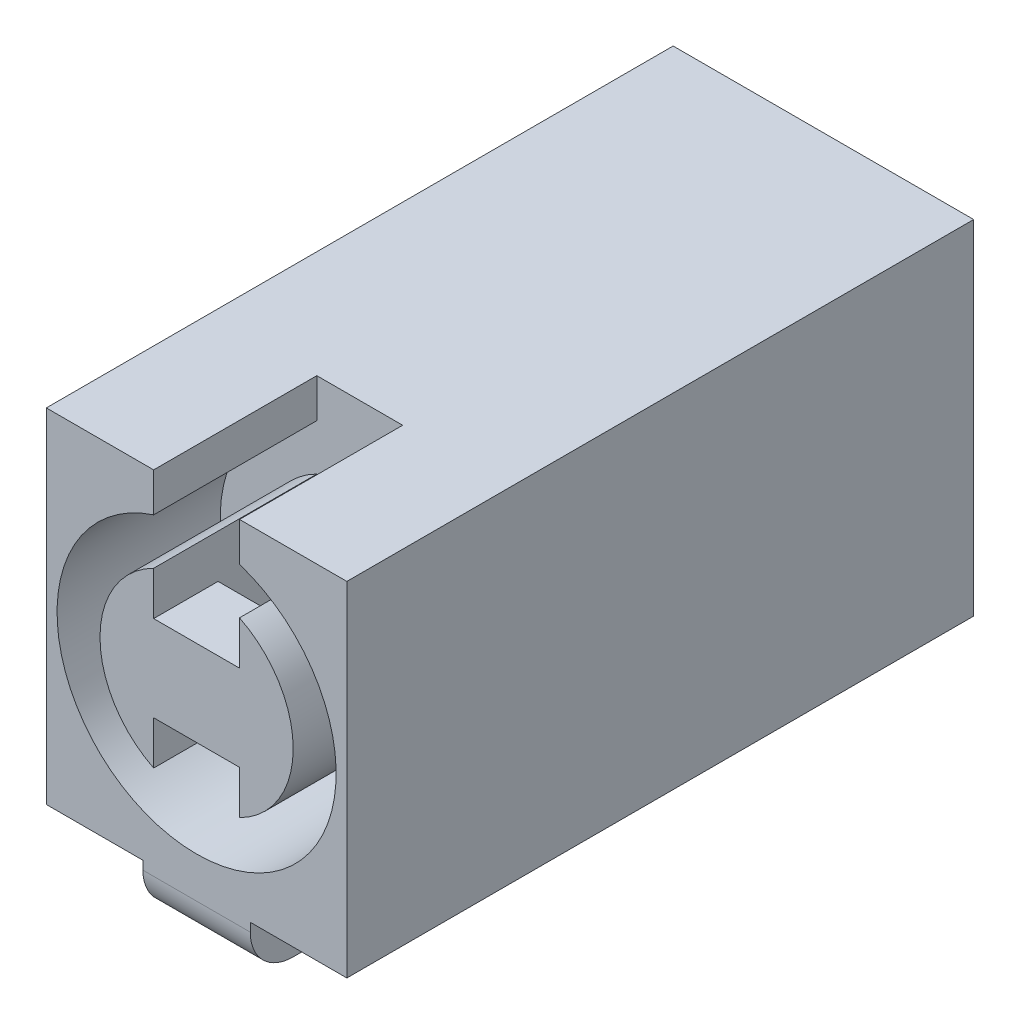
ISO-10303-21;
HEADER;
FILE_DESCRIPTION(('STEP AP214'),'2;1');
FILE_NAME('part.step','',(''),(''),'','','');
FILE_SCHEMA(('AUTOMOTIVE_DESIGN { 1 0 10303 214 1 1 1 1 }'));
ENDSEC;
DATA;
#1=APPLICATION_CONTEXT('core data for automotive mechanical design processes');
#2=APPLICATION_PROTOCOL_DEFINITION('international standard','automotive_design',2000,#1);
#3=PRODUCT_CONTEXT('',#1,'mechanical');
#4=PRODUCT('Part','Part','',(#3));
#5=PRODUCT_RELATED_PRODUCT_CATEGORY('part','',(#4));
#6=PRODUCT_DEFINITION_FORMATION('','',#4);
#7=PRODUCT_DEFINITION_CONTEXT('part definition',#1,'design');
#8=PRODUCT_DEFINITION('design','',#6,#7);
#9=PRODUCT_DEFINITION_SHAPE('','',#8);
#10=(LENGTH_UNIT() NAMED_UNIT(*) SI_UNIT(.MILLI.,.METRE.));
#11=(NAMED_UNIT(*) PLANE_ANGLE_UNIT() SI_UNIT($,.RADIAN.));
#12=(NAMED_UNIT(*) SI_UNIT($,.STERADIAN.) SOLID_ANGLE_UNIT());
#13=UNCERTAINTY_MEASURE_WITH_UNIT(LENGTH_MEASURE(1.E-05),#10,'distance_accuracy_value','');
#14=(GEOMETRIC_REPRESENTATION_CONTEXT(3) GLOBAL_UNCERTAINTY_ASSIGNED_CONTEXT((#13)) GLOBAL_UNIT_ASSIGNED_CONTEXT((#10,
#11,#12)) REPRESENTATION_CONTEXT('',''));
#15=CARTESIAN_POINT('',(0.,0.,0.));
#16=DIRECTION('',(0.,0.,1.));
#17=DIRECTION('',(1.,0.,0.));
#18=AXIS2_PLACEMENT_3D('',#15,#16,#17);
#19=CARTESIAN_POINT('',(2.5,3.5,-9.8));
#20=DIRECTION('',(-1.,0.,0.));
#21=DIRECTION('',(0.,0.,1.));
#22=AXIS2_PLACEMENT_3D('',#19,#20,#21);
#23=PLANE('',#22);
#24=DIRECTION('',(0.,1.,0.));
#25=VECTOR('',#24,1.);
#26=CARTESIAN_POINT('',(2.5,2.5,-7.8));
#27=LINE('',#26,#25);
#28=CARTESIAN_POINT('',(2.5,2.5,-7.8));
#29=VERTEX_POINT('',#28);
#30=CARTESIAN_POINT('',(2.5,3.5,-7.8));
#31=VERTEX_POINT('',#30);
#32=EDGE_CURVE('E606',#29,#31,#27,.T.);
#33=ORIENTED_EDGE('',*,*,#32,.F.);
#34=DIRECTION('',(0.,0.,-1.));
#35=VECTOR('',#34,1.);
#36=CARTESIAN_POINT('',(2.5,2.5,-7.8));
#37=LINE('',#36,#35);
#38=CARTESIAN_POINT('',(2.5,2.5,-6.8));
#39=VERTEX_POINT('',#38);
#40=EDGE_CURVE('E572',#39,#29,#37,.T.);
#41=ORIENTED_EDGE('',*,*,#40,.F.);
#42=DIRECTION('',(0.,1.,0.));
#43=VECTOR('',#42,1.);
#44=CARTESIAN_POINT('',(2.5,2.5,-6.8));
#45=LINE('',#44,#43);
#46=CARTESIAN_POINT('',(2.5,3.5,-6.8));
#47=VERTEX_POINT('',#46);
#48=EDGE_CURVE('E589',#39,#47,#45,.T.);
#49=ORIENTED_EDGE('',*,*,#48,.T.);
#50=DIRECTION('',(0.,0.,-1.));
#51=VECTOR('',#50,1.);
#52=CARTESIAN_POINT('',(2.5,3.5,-9.8));
#53=LINE('',#52,#51);
#54=CARTESIAN_POINT('',(2.5,3.5,-4.8));
#55=VERTEX_POINT('',#54);
#56=EDGE_CURVE('E409',#55,#47,#53,.T.);
#57=ORIENTED_EDGE('',*,*,#56,.F.);
#58=DIRECTION('',(0.,-1.,0.));
#59=VECTOR('',#58,1.);
#60=CARTESIAN_POINT('',(2.5,3.5,-4.8));
#61=LINE('',#60,#59);
#62=CARTESIAN_POINT('',(2.5,0.,-4.8));
#63=VERTEX_POINT('',#62);
#64=EDGE_CURVE('E309',#55,#63,#61,.T.);
#65=ORIENTED_EDGE('',*,*,#64,.T.);
#66=DIRECTION('',(0.,0.,-1.));
#67=VECTOR('',#66,1.);
#68=CARTESIAN_POINT('',(2.5,0.,-9.8));
#69=LINE('',#68,#67);
#70=CARTESIAN_POINT('',(2.5,0.,-9.8));
#71=VERTEX_POINT('',#70);
#72=EDGE_CURVE('E427',#63,#71,#69,.T.);
#73=ORIENTED_EDGE('',*,*,#72,.T.);
#74=DIRECTION('',(0.,-1.,0.));
#75=VECTOR('',#74,1.);
#76=CARTESIAN_POINT('',(2.5,3.5,-9.8));
#77=LINE('',#76,#75);
#78=CARTESIAN_POINT('',(2.5,3.5,-9.8));
#79=VERTEX_POINT('',#78);
#80=EDGE_CURVE('E426',#79,#71,#77,.T.);
#81=ORIENTED_EDGE('',*,*,#80,.F.);
#82=EDGE_CURVE('E413',#31,#79,#53,.T.);
#83=ORIENTED_EDGE('',*,*,#82,.F.);
#84=EDGE_LOOP('',(#33,#41,#49,#57,#65,#73,#81,#83));
#85=FACE_BOUND('',#84,.T.);
#86=ADVANCED_FACE('F40',(#85),#23,.F.);
#87=CARTESIAN_POINT('',(4.5,3.5,-9.8));
#88=DIRECTION('',(1.,0.,0.));
#89=DIRECTION('',(0.,0.,-1.));
#90=AXIS2_PLACEMENT_3D('',#87,#88,#89);
#91=PLANE('',#90);
#92=DIRECTION('',(0.,1.,0.));
#93=VECTOR('',#92,1.);
#94=CARTESIAN_POINT('',(4.5,2.5,-7.8));
#95=LINE('',#94,#93);
#96=CARTESIAN_POINT('',(4.5,2.5,-7.8));
#97=VERTEX_POINT('',#96);
#98=CARTESIAN_POINT('',(4.5,3.5,-7.8));
#99=VERTEX_POINT('',#98);
#100=EDGE_CURVE('E603',#97,#99,#95,.T.);
#101=ORIENTED_EDGE('',*,*,#100,.T.);
#102=DIRECTION('',(0.,0.,1.));
#103=VECTOR('',#102,1.);
#104=CARTESIAN_POINT('',(4.5,3.5,-9.8));
#105=LINE('',#104,#103);
#106=CARTESIAN_POINT('',(4.5,3.5,-9.8));
#107=VERTEX_POINT('',#106);
#108=EDGE_CURVE('E418',#107,#99,#105,.T.);
#109=ORIENTED_EDGE('',*,*,#108,.F.);
#110=DIRECTION('',(0.,-1.,0.));
#111=VECTOR('',#110,1.);
#112=CARTESIAN_POINT('',(4.5,3.5,-9.8));
#113=LINE('',#112,#111);
#114=CARTESIAN_POINT('',(4.5,0.,-9.8));
#115=VERTEX_POINT('',#114);
#116=EDGE_CURVE('E441',#107,#115,#113,.T.);
#117=ORIENTED_EDGE('',*,*,#116,.T.);
#118=DIRECTION('',(0.,0.,1.));
#119=VECTOR('',#118,1.);
#120=CARTESIAN_POINT('',(4.5,0.,-9.8));
#121=LINE('',#120,#119);
#122=CARTESIAN_POINT('',(4.5,0.,-4.8));
#123=VERTEX_POINT('',#122);
#124=EDGE_CURVE('E431',#115,#123,#121,.T.);
#125=ORIENTED_EDGE('',*,*,#124,.T.);
#126=DIRECTION('',(0.,-1.,0.));
#127=VECTOR('',#126,1.);
#128=CARTESIAN_POINT('',(4.5,3.5,-4.8));
#129=LINE('',#128,#127);
#130=CARTESIAN_POINT('',(4.5,3.5,-4.8));
#131=VERTEX_POINT('',#130);
#132=EDGE_CURVE('E437',#131,#123,#129,.T.);
#133=ORIENTED_EDGE('',*,*,#132,.F.);
#134=CARTESIAN_POINT('',(4.5,3.5,-6.8));
#135=VERTEX_POINT('',#134);
#136=EDGE_CURVE('E417',#135,#131,#105,.T.);
#137=ORIENTED_EDGE('',*,*,#136,.F.);
#138=DIRECTION('',(0.,1.,0.));
#139=VECTOR('',#138,1.);
#140=CARTESIAN_POINT('',(4.5,2.5,-6.8));
#141=LINE('',#140,#139);
#142=CARTESIAN_POINT('',(4.5,2.5,-6.8));
#143=VERTEX_POINT('',#142);
#144=EDGE_CURVE('E599',#143,#135,#141,.T.);
#145=ORIENTED_EDGE('',*,*,#144,.F.);
#146=DIRECTION('',(0.,0.,1.));
#147=VECTOR('',#146,1.);
#148=CARTESIAN_POINT('',(4.5,2.5,-7.8));
#149=LINE('',#148,#147);
#150=EDGE_CURVE('E581',#97,#143,#149,.T.);
#151=ORIENTED_EDGE('',*,*,#150,.F.);
#152=EDGE_LOOP('',(#101,#109,#117,#125,#133,#137,#145,#151));
#153=FACE_BOUND('',#152,.T.);
#154=ADVANCED_FACE('F700',(#153),#91,.F.);
#155=CARTESIAN_POINT('',(0.,3.5,0.));
#156=DIRECTION('',(0.,1.,0.));
#157=DIRECTION('',(0.,0.,1.));
#158=AXIS2_PLACEMENT_3D('',#155,#156,#157);
#159=PLANE('',#158);
#160=DIRECTION('',(1.,0.,0.));
#161=VECTOR('',#160,1.);
#162=CARTESIAN_POINT('',(2.5,3.5,-7.8));
#163=LINE('',#162,#161);
#164=EDGE_CURVE('E567',#31,#99,#163,.T.);
#165=ORIENTED_EDGE('',*,*,#164,.F.);
#166=ORIENTED_EDGE('',*,*,#82,.T.);
#167=DIRECTION('',(1.,0.,0.));
#168=VECTOR('',#167,1.);
#169=CARTESIAN_POINT('',(2.5,3.5,-9.8));
#170=LINE('',#169,#168);
#171=EDGE_CURVE('E412',#79,#107,#170,.T.);
#172=ORIENTED_EDGE('',*,*,#171,.T.);
#173=ORIENTED_EDGE('',*,*,#108,.T.);
#174=EDGE_LOOP('',(#165,#166,#172,#173));
#175=FACE_BOUND('',#174,.T.);
#176=ADVANCED_FACE('F705',(#175),#159,.F.);
#177=DIRECTION('',(-1.,0.,0.));
#178=VECTOR('',#177,1.);
#179=CARTESIAN_POINT('',(2.5,3.5,-6.8));
#180=LINE('',#179,#178);
#181=EDGE_CURVE('E577',#135,#47,#180,.T.);
#182=ORIENTED_EDGE('',*,*,#181,.F.);
#183=ORIENTED_EDGE('',*,*,#136,.T.);
#184=DIRECTION('',(-1.,0.,0.));
#185=VECTOR('',#184,1.);
#186=CARTESIAN_POINT('',(2.5,3.5,-4.8));
#187=LINE('',#186,#185);
#188=EDGE_CURVE('E422',#131,#55,#187,.T.);
#189=ORIENTED_EDGE('',*,*,#188,.T.);
#190=ORIENTED_EDGE('',*,*,#56,.T.);
#191=EDGE_LOOP('',(#182,#183,#189,#190));
#192=FACE_BOUND('',#191,.T.);
#193=ADVANCED_FACE('F709',(#192),#159,.F.);
#194=CARTESIAN_POINT('',(0.,0.,0.));
#195=DIRECTION('',(0.,-1.,0.));
#196=DIRECTION('',(0.,0.,-1.));
#197=AXIS2_PLACEMENT_3D('',#194,#195,#196);
#198=PLANE('',#197);
#199=DIRECTION('',(-1.,0.,0.));
#200=VECTOR('',#199,1.);
#201=CARTESIAN_POINT('',(0.,0.,-14.6));
#202=LINE('',#201,#200);
#203=CARTESIAN_POINT('',(2.25,0.,-14.6));
#204=VERTEX_POINT('',#203);
#205=CARTESIAN_POINT('',(0.,0.,-14.6));
#206=VERTEX_POINT('',#205);
#207=EDGE_CURVE('E317',#204,#206,#202,.T.);
#208=ORIENTED_EDGE('',*,*,#207,.F.);
#209=DIRECTION('',(0.,0.,-1.));
#210=VECTOR('',#209,1.);
#211=CARTESIAN_POINT('',(2.25,0.,-9.8));
#212=LINE('',#211,#210);
#213=CARTESIAN_POINT('',(2.25,0.,-9.8));
#214=VERTEX_POINT('',#213);
#215=EDGE_CURVE('E609',#214,#204,#212,.T.);
#216=ORIENTED_EDGE('',*,*,#215,.F.);
#217=DIRECTION('',(-1.,0.,0.));
#218=VECTOR('',#217,1.);
#219=CARTESIAN_POINT('',(2.25,0.,-9.8));
#220=LINE('',#219,#218);
#221=EDGE_CURVE('E451',#71,#214,#220,.T.);
#222=ORIENTED_EDGE('',*,*,#221,.F.);
#223=ORIENTED_EDGE('',*,*,#72,.F.);
#224=DIRECTION('',(1.,0.,0.));
#225=VECTOR('',#224,1.);
#226=CARTESIAN_POINT('',(2.25,0.,-4.8));
#227=LINE('',#226,#225);
#228=CARTESIAN_POINT('',(2.25,0.,-4.8));
#229=VERTEX_POINT('',#228);
#230=EDGE_CURVE('E369',#229,#63,#227,.T.);
#231=ORIENTED_EDGE('',*,*,#230,.F.);
#232=DIRECTION('',(0.,0.,-1.));
#233=VECTOR('',#232,1.);
#234=CARTESIAN_POINT('',(2.25,0.,-4.8));
#235=LINE('',#234,#233);
#236=CARTESIAN_POINT('',(2.25,0.,0.));
#237=VERTEX_POINT('',#236);
#238=EDGE_CURVE('E474',#237,#229,#235,.T.);
#239=ORIENTED_EDGE('',*,*,#238,.F.);
#240=DIRECTION('',(1.,0.,0.));
#241=VECTOR('',#240,1.);
#242=CARTESIAN_POINT('',(0.,0.,0.));
#243=LINE('',#242,#241);
#244=CARTESIAN_POINT('',(0.,0.,0.));
#245=VERTEX_POINT('',#244);
#246=EDGE_CURVE('E310',#245,#237,#243,.T.);
#247=ORIENTED_EDGE('',*,*,#246,.F.);
#248=DIRECTION('',(0.,0.,1.));
#249=VECTOR('',#248,1.);
#250=CARTESIAN_POINT('',(0.,0.,0.));
#251=LINE('',#250,#249);
#252=EDGE_CURVE('E304',#206,#245,#251,.T.);
#253=ORIENTED_EDGE('',*,*,#252,.F.);
#254=EDGE_LOOP('',(#208,#216,#222,#223,#231,#239,#247,#253));
#255=FACE_BOUND('',#254,.T.);
#256=ADVANCED_FACE('F461',(#255),#198,.T.);
#257=CARTESIAN_POINT('',(4.75,0.,-9.8));
#258=VERTEX_POINT('',#257);
#259=EDGE_CURVE('E615',#258,#115,#220,.T.);
#260=ORIENTED_EDGE('',*,*,#259,.F.);
#261=DIRECTION('',(0.,0.,1.));
#262=VECTOR('',#261,1.);
#263=CARTESIAN_POINT('',(4.75,0.,-9.8));
#264=LINE('',#263,#262);
#265=CARTESIAN_POINT('',(4.75,0.,-14.6));
#266=VERTEX_POINT('',#265);
#267=EDGE_CURVE('E625',#266,#258,#264,.T.);
#268=ORIENTED_EDGE('',*,*,#267,.F.);
#269=CARTESIAN_POINT('',(7.,0.,-14.6));
#270=VERTEX_POINT('',#269);
#271=EDGE_CURVE('E318',#270,#266,#202,.T.);
#272=ORIENTED_EDGE('',*,*,#271,.F.);
#273=DIRECTION('',(0.,0.,-1.));
#274=VECTOR('',#273,1.);
#275=CARTESIAN_POINT('',(7.,0.,0.));
#276=LINE('',#275,#274);
#277=CARTESIAN_POINT('',(7.,0.,0.));
#278=VERTEX_POINT('',#277);
#279=EDGE_CURVE('E314',#278,#270,#276,.T.);
#280=ORIENTED_EDGE('',*,*,#279,.F.);
#281=CARTESIAN_POINT('',(4.75,0.,0.));
#282=VERTEX_POINT('',#281);
#283=EDGE_CURVE('E308',#282,#278,#243,.T.);
#284=ORIENTED_EDGE('',*,*,#283,.F.);
#285=DIRECTION('',(0.,0.,1.));
#286=VECTOR('',#285,1.);
#287=CARTESIAN_POINT('',(4.75,0.,-4.8));
#288=LINE('',#287,#286);
#289=CARTESIAN_POINT('',(4.75,0.,-4.8));
#290=VERTEX_POINT('',#289);
#291=EDGE_CURVE('E473',#290,#282,#288,.T.);
#292=ORIENTED_EDGE('',*,*,#291,.F.);
#293=EDGE_CURVE('E345',#123,#290,#227,.T.);
#294=ORIENTED_EDGE('',*,*,#293,.F.);
#295=ORIENTED_EDGE('',*,*,#124,.F.);
#296=EDGE_LOOP('',(#260,#268,#272,#280,#284,#292,#294,#295));
#297=FACE_BOUND('',#296,.T.);
#298=ADVANCED_FACE('F681',(#297),#198,.T.);
#299=CARTESIAN_POINT('',(4.5,7.09232921921324,-3.8));
#300=DIRECTION('',(1.,0.,0.));
#301=DIRECTION('',(0.,1.,0.));
#302=AXIS2_PLACEMENT_3D('',#299,#300,#301);
#303=PLANE('',#302);
#304=DIRECTION('',(0.,0.,1.));
#305=VECTOR('',#304,1.);
#306=CARTESIAN_POINT('',(4.5,5.,0.));
#307=LINE('',#306,#305);
#308=CARTESIAN_POINT('',(4.5,5.,-1.5));
#309=VERTEX_POINT('',#308);
#310=CARTESIAN_POINT('',(4.5,5.,0.));
#311=VERTEX_POINT('',#310);
#312=EDGE_CURVE('E505',#309,#311,#307,.T.);
#313=ORIENTED_EDGE('',*,*,#312,.T.);
#314=DIRECTION('',(0.,-1.,0.));
#315=VECTOR('',#314,1.);
#316=CARTESIAN_POINT('',(4.5,8.,0.));
#317=LINE('',#316,#315);
#318=CARTESIAN_POINT('',(4.5,6.01556443707464,0.));
#319=VERTEX_POINT('',#318);
#320=EDGE_CURVE('E342',#319,#311,#317,.T.);
#321=ORIENTED_EDGE('',*,*,#320,.F.);
#322=DIRECTION('',(0.,0.,1.));
#323=VECTOR('',#322,1.);
#324=CARTESIAN_POINT('',(4.5,6.01556443707464,-3.8));
#325=LINE('',#324,#323);
#326=CARTESIAN_POINT('',(4.5,6.01556443707464,-3.8));
#327=VERTEX_POINT('',#326);
#328=EDGE_CURVE('E404',#319,#327,#325,.F.);
#329=ORIENTED_EDGE('',*,*,#328,.T.);
#330=DIRECTION('',(0.,1.,0.));
#331=VECTOR('',#330,1.);
#332=CARTESIAN_POINT('',(4.5,7.09232921921324,-3.8));
#333=LINE('',#332,#331);
#334=CARTESIAN_POINT('',(4.5,1.98443556292536,-3.8));
#335=VERTEX_POINT('',#334);
#336=EDGE_CURVE('E532',#335,#327,#333,.T.);
#337=ORIENTED_EDGE('',*,*,#336,.F.);
#338=DIRECTION('',(0.,0.,1.));
#339=VECTOR('',#338,1.);
#340=CARTESIAN_POINT('',(4.5,1.98443556292536,-3.8));
#341=LINE('',#340,#339);
#342=CARTESIAN_POINT('',(4.5,1.98443556292536,0.));
#343=VERTEX_POINT('',#342);
#344=EDGE_CURVE('E539',#335,#343,#341,.T.);
#345=ORIENTED_EDGE('',*,*,#344,.T.);
#346=CARTESIAN_POINT('',(4.5,3.,0.));
#347=VERTEX_POINT('',#346);
#348=EDGE_CURVE('E341',#347,#343,#317,.T.);
#349=ORIENTED_EDGE('',*,*,#348,.F.);
#350=DIRECTION('',(0.,0.,-1.));
#351=VECTOR('',#350,1.);
#352=CARTESIAN_POINT('',(4.5,3.,0.));
#353=LINE('',#352,#351);
#354=CARTESIAN_POINT('',(4.5,3.,-1.5));
#355=VERTEX_POINT('',#354);
#356=EDGE_CURVE('E498',#347,#355,#353,.T.);
#357=ORIENTED_EDGE('',*,*,#356,.T.);
#358=DIRECTION('',(0.,1.,0.));
#359=VECTOR('',#358,1.);
#360=CARTESIAN_POINT('',(4.5,5.,-1.5));
#361=LINE('',#360,#359);
#362=EDGE_CURVE('E501',#355,#309,#361,.T.);
#363=ORIENTED_EDGE('',*,*,#362,.T.);
#364=EDGE_LOOP('',(#313,#321,#329,#337,#345,#349,#357,#363));
#365=FACE_BOUND('',#364,.T.);
#366=ADVANCED_FACE('F789',(#365),#303,.F.);
#367=CARTESIAN_POINT('',(2.5,7.09232921921324,-3.8));
#368=DIRECTION('',(-1.,0.,0.));
#369=DIRECTION('',(0.,-1.,0.));
#370=AXIS2_PLACEMENT_3D('',#367,#368,#369);
#371=PLANE('',#370);
#372=DIRECTION('',(0.,0.,1.));
#373=VECTOR('',#372,1.);
#374=CARTESIAN_POINT('',(2.5,1.98443556292536,-3.8));
#375=LINE('',#374,#373);
#376=CARTESIAN_POINT('',(2.5,1.98443556292536,0.));
#377=VERTEX_POINT('',#376);
#378=CARTESIAN_POINT('',(2.5,1.98443556292536,-3.8));
#379=VERTEX_POINT('',#378);
#380=EDGE_CURVE('E392',#377,#379,#375,.F.);
#381=ORIENTED_EDGE('',*,*,#380,.T.);
#382=DIRECTION('',(0.,-1.,0.));
#383=VECTOR('',#382,1.);
#384=CARTESIAN_POINT('',(2.5,7.09232921921324,-3.8));
#385=LINE('',#384,#383);
#386=CARTESIAN_POINT('',(2.5,6.01556443707464,-3.8));
#387=VERTEX_POINT('',#386);
#388=EDGE_CURVE('E387',#387,#379,#385,.T.);
#389=ORIENTED_EDGE('',*,*,#388,.F.);
#390=DIRECTION('',(0.,0.,1.));
#391=VECTOR('',#390,1.);
#392=CARTESIAN_POINT('',(2.5,6.01556443707464,-3.8));
#393=LINE('',#392,#391);
#394=CARTESIAN_POINT('',(2.5,6.01556443707464,0.));
#395=VERTEX_POINT('',#394);
#396=EDGE_CURVE('E384',#387,#395,#393,.T.);
#397=ORIENTED_EDGE('',*,*,#396,.T.);
#398=DIRECTION('',(0.,1.,0.));
#399=VECTOR('',#398,1.);
#400=CARTESIAN_POINT('',(2.5,8.,0.));
#401=LINE('',#400,#399);
#402=CARTESIAN_POINT('',(2.5,5.,0.));
#403=VERTEX_POINT('',#402);
#404=EDGE_CURVE('E336',#403,#395,#401,.T.);
#405=ORIENTED_EDGE('',*,*,#404,.F.);
#406=DIRECTION('',(0.,0.,1.));
#407=VECTOR('',#406,1.);
#408=CARTESIAN_POINT('',(2.5,5.,0.));
#409=LINE('',#408,#407);
#410=CARTESIAN_POINT('',(2.5,5.,-1.5));
#411=VERTEX_POINT('',#410);
#412=EDGE_CURVE('E502',#411,#403,#409,.T.);
#413=ORIENTED_EDGE('',*,*,#412,.F.);
#414=DIRECTION('',(0.,1.,0.));
#415=VECTOR('',#414,1.);
#416=CARTESIAN_POINT('',(2.5,5.,-1.5));
#417=LINE('',#416,#415);
#418=CARTESIAN_POINT('',(2.5,3.,-1.5));
#419=VERTEX_POINT('',#418);
#420=EDGE_CURVE('E512',#419,#411,#417,.T.);
#421=ORIENTED_EDGE('',*,*,#420,.F.);
#422=DIRECTION('',(0.,0.,-1.));
#423=VECTOR('',#422,1.);
#424=CARTESIAN_POINT('',(2.5,3.,0.));
#425=LINE('',#424,#423);
#426=CARTESIAN_POINT('',(2.5,3.,0.));
#427=VERTEX_POINT('',#426);
#428=EDGE_CURVE('E497',#427,#419,#425,.T.);
#429=ORIENTED_EDGE('',*,*,#428,.F.);
#430=EDGE_CURVE('E337',#377,#427,#401,.T.);
#431=ORIENTED_EDGE('',*,*,#430,.F.);
#432=EDGE_LOOP('',(#381,#389,#397,#405,#413,#421,#429,#431));
#433=FACE_BOUND('',#432,.T.);
#434=ADVANCED_FACE('F386',(#433),#371,.F.);
#435=CARTESIAN_POINT('',(3.5,4.,-3.8));
#436=DIRECTION('',(0.,0.,1.));
#437=DIRECTION('',(1.,0.,0.));
#438=AXIS2_PLACEMENT_3D('',#435,#436,#437);
#439=CYLINDRICAL_SURFACE('',#438,2.25);
#440=ORIENTED_EDGE('',*,*,#328,.F.);
#441=CARTESIAN_POINT('',(3.5,4.,0.));
#442=DIRECTION('',(0.,0.,1.));
#443=DIRECTION('',(1.,0.,0.));
#444=AXIS2_PLACEMENT_3D('',#441,#442,#443);
#445=CIRCLE('',#444,2.25);
#446=EDGE_CURVE('E397',#343,#319,#445,.T.);
#447=ORIENTED_EDGE('',*,*,#446,.F.);
#448=ORIENTED_EDGE('',*,*,#344,.F.);
#449=CARTESIAN_POINT('',(3.5,4.,-3.8));
#450=DIRECTION('',(0.,0.,1.));
#451=DIRECTION('',(1.,0.,0.));
#452=AXIS2_PLACEMENT_3D('',#449,#450,#451);
#453=CIRCLE('',#452,2.25);
#454=EDGE_CURVE('E401',#335,#327,#453,.T.);
#455=ORIENTED_EDGE('',*,*,#454,.T.);
#456=EDGE_LOOP('',(#440,#447,#448,#455));
#457=FACE_BOUND('',#456,.T.);
#458=ADVANCED_FACE('F747',(#457),#439,.T.);
#459=CARTESIAN_POINT('',(0.,8.,0.));
#460=DIRECTION('',(1.,0.,0.));
#461=DIRECTION('',(0.,0.,-1.));
#462=AXIS2_PLACEMENT_3D('',#459,#460,#461);
#463=PLANE('',#462);
#464=ORIENTED_EDGE('',*,*,#252,.T.);
#465=DIRECTION('',(0.,-1.,0.));
#466=VECTOR('',#465,1.);
#467=CARTESIAN_POINT('',(0.,8.,0.));
#468=LINE('',#467,#466);
#469=CARTESIAN_POINT('',(0.,8.,0.));
#470=VERTEX_POINT('',#469);
#471=EDGE_CURVE('E333',#470,#245,#468,.T.);
#472=ORIENTED_EDGE('',*,*,#471,.F.);
#473=DIRECTION('',(0.,0.,1.));
#474=VECTOR('',#473,1.);
#475=CARTESIAN_POINT('',(0.,8.,0.));
#476=LINE('',#475,#474);
#477=CARTESIAN_POINT('',(0.,8.,-14.6));
#478=VERTEX_POINT('',#477);
#479=EDGE_CURVE('E288',#478,#470,#476,.T.);
#480=ORIENTED_EDGE('',*,*,#479,.F.);
#481=DIRECTION('',(0.,-1.,0.));
#482=VECTOR('',#481,1.);
#483=CARTESIAN_POINT('',(0.,8.,-14.6));
#484=LINE('',#483,#482);
#485=EDGE_CURVE('E303',#478,#206,#484,.T.);
#486=ORIENTED_EDGE('',*,*,#485,.T.);
#487=EDGE_LOOP('',(#464,#472,#480,#486));
#488=FACE_BOUND('',#487,.T.);
#489=ADVANCED_FACE('F660',(#488),#463,.F.);
#490=CARTESIAN_POINT('',(0.,8.,0.));
#491=DIRECTION('',(0.,0.,-1.));
#492=DIRECTION('',(-1.,0.,0.));
#493=AXIS2_PLACEMENT_3D('',#490,#491,#492);
#494=PLANE('',#493);
#495=CARTESIAN_POINT('',(3.5,4.,0.));
#496=DIRECTION('',(0.,0.,1.));
#497=DIRECTION('',(1.,0.,0.));
#498=AXIS2_PLACEMENT_3D('',#495,#496,#497);
#499=CIRCLE('',#498,3.25);
#500=CARTESIAN_POINT('',(2.5,7.09232921921324,0.));
#501=VERTEX_POINT('',#500);
#502=CARTESIAN_POINT('',(4.5,7.09232921921324,0.));
#503=VERTEX_POINT('',#502);
#504=EDGE_CURVE('E281',#501,#503,#499,.T.);
#505=ORIENTED_EDGE('',*,*,#504,.F.);
#506=DIRECTION('',(0.,1.,0.));
#507=VECTOR('',#506,1.);
#508=CARTESIAN_POINT('',(2.5,6.,0.));
#509=LINE('',#508,#507);
#510=CARTESIAN_POINT('',(2.5,8.,0.));
#511=VERTEX_POINT('',#510);
#512=EDGE_CURVE('E263',#501,#511,#509,.T.);
#513=ORIENTED_EDGE('',*,*,#512,.T.);
#514=DIRECTION('',(1.,0.,0.));
#515=VECTOR('',#514,1.);
#516=CARTESIAN_POINT('',(0.,8.,0.));
#517=LINE('',#516,#515);
#518=EDGE_CURVE('E277',#470,#511,#517,.T.);
#519=ORIENTED_EDGE('',*,*,#518,.F.);
#520=ORIENTED_EDGE('',*,*,#471,.T.);
#521=ORIENTED_EDGE('',*,*,#246,.T.);
#522=DIRECTION('',(0.,1.,0.));
#523=VECTOR('',#522,1.);
#524=CARTESIAN_POINT('',(2.25,-1.2,0.));
#525=LINE('',#524,#523);
#526=CARTESIAN_POINT('',(2.25,-0.2,0.));
#527=VERTEX_POINT('',#526);
#528=EDGE_CURVE('E484',#527,#237,#525,.T.);
#529=ORIENTED_EDGE('',*,*,#528,.F.);
#530=DIRECTION('',(-1.,0.,0.));
#531=VECTOR('',#530,1.);
#532=CARTESIAN_POINT('',(0.,-0.200000000000001,0.));
#533=LINE('',#532,#531);
#534=CARTESIAN_POINT('',(4.75,-0.2,0.));
#535=VERTEX_POINT('',#534);
#536=EDGE_CURVE('E49',#527,#535,#533,.F.);
#537=ORIENTED_EDGE('',*,*,#536,.T.);
#538=DIRECTION('',(0.,1.,0.));
#539=VECTOR('',#538,1.);
#540=CARTESIAN_POINT('',(4.75,-1.2,0.));
#541=LINE('',#540,#539);
#542=EDGE_CURVE('E487',#535,#282,#541,.T.);
#543=ORIENTED_EDGE('',*,*,#542,.T.);
#544=ORIENTED_EDGE('',*,*,#283,.T.);
#545=DIRECTION('',(0.,-1.,0.));
#546=VECTOR('',#545,1.);
#547=CARTESIAN_POINT('',(7.,8.,0.));
#548=LINE('',#547,#546);
#549=CARTESIAN_POINT('',(7.,8.,0.));
#550=VERTEX_POINT('',#549);
#551=EDGE_CURVE('E329',#550,#278,#548,.T.);
#552=ORIENTED_EDGE('',*,*,#551,.F.);
#553=CARTESIAN_POINT('',(4.5,8.,0.));
#554=VERTEX_POINT('',#553);
#555=EDGE_CURVE('E292',#554,#550,#517,.T.);
#556=ORIENTED_EDGE('',*,*,#555,.F.);
#557=DIRECTION('',(0.,1.,0.));
#558=VECTOR('',#557,1.);
#559=CARTESIAN_POINT('',(4.5,6.,0.));
#560=LINE('',#559,#558);
#561=EDGE_CURVE('E283',#503,#554,#560,.T.);
#562=ORIENTED_EDGE('',*,*,#561,.F.);
#563=EDGE_LOOP('',(#505,#513,#519,#520,#521,#529,#537,#543,#544,#552,#556,#562));
#564=FACE_BOUND('',#563,.T.);
#565=ADVANCED_FACE('F275',(#564),#494,.F.);
#566=CARTESIAN_POINT('',(7.,8.,0.));
#567=DIRECTION('',(-1.,0.,0.));
#568=DIRECTION('',(0.,0.,1.));
#569=AXIS2_PLACEMENT_3D('',#566,#567,#568);
#570=PLANE('',#569);
#571=ORIENTED_EDGE('',*,*,#279,.T.);
#572=DIRECTION('',(0.,-1.,0.));
#573=VECTOR('',#572,1.);
#574=CARTESIAN_POINT('',(7.,8.,-14.6));
#575=LINE('',#574,#573);
#576=CARTESIAN_POINT('',(7.,8.,-14.6));
#577=VERTEX_POINT('',#576);
#578=EDGE_CURVE('E325',#577,#270,#575,.T.);
#579=ORIENTED_EDGE('',*,*,#578,.F.);
#580=DIRECTION('',(0.,0.,-1.));
#581=VECTOR('',#580,1.);
#582=CARTESIAN_POINT('',(7.,8.,0.));
#583=LINE('',#582,#581);
#584=EDGE_CURVE('E291',#550,#577,#583,.T.);
#585=ORIENTED_EDGE('',*,*,#584,.F.);
#586=ORIENTED_EDGE('',*,*,#551,.T.);
#587=EDGE_LOOP('',(#571,#579,#585,#586));
#588=FACE_BOUND('',#587,.T.);
#589=ADVANCED_FACE('F677',(#588),#570,.F.);
#590=CARTESIAN_POINT('',(0.,8.,-14.6));
#591=DIRECTION('',(0.,0.,1.));
#592=DIRECTION('',(1.,0.,0.));
#593=AXIS2_PLACEMENT_3D('',#590,#591,#592);
#594=PLANE('',#593);
#595=DIRECTION('',(0.,1.,0.));
#596=VECTOR('',#595,1.);
#597=CARTESIAN_POINT('',(4.75,-1.2,-14.6));
#598=LINE('',#597,#596);
#599=CARTESIAN_POINT('',(4.75,-0.2,-14.6));
#600=VERTEX_POINT('',#599);
#601=EDGE_CURVE('E636',#600,#266,#598,.T.);
#602=ORIENTED_EDGE('',*,*,#601,.F.);
#603=DIRECTION('',(1.,0.,0.));
#604=VECTOR('',#603,1.);
#605=CARTESIAN_POINT('',(2.25,-0.2,-14.6));
#606=LINE('',#605,#604);
#607=CARTESIAN_POINT('',(2.25,-0.2,-14.6));
#608=VERTEX_POINT('',#607);
#609=EDGE_CURVE('E353',#600,#608,#606,.F.);
#610=ORIENTED_EDGE('',*,*,#609,.T.);
#611=DIRECTION('',(0.,1.,0.));
#612=VECTOR('',#611,1.);
#613=CARTESIAN_POINT('',(2.25,-1.2,-14.6));
#614=LINE('',#613,#612);
#615=EDGE_CURVE('E480',#608,#204,#614,.T.);
#616=ORIENTED_EDGE('',*,*,#615,.T.);
#617=ORIENTED_EDGE('',*,*,#207,.T.);
#618=ORIENTED_EDGE('',*,*,#485,.F.);
#619=DIRECTION('',(-1.,0.,0.));
#620=VECTOR('',#619,1.);
#621=CARTESIAN_POINT('',(0.,8.,-14.6));
#622=LINE('',#621,#620);
#623=EDGE_CURVE('E296',#577,#478,#622,.T.);
#624=ORIENTED_EDGE('',*,*,#623,.F.);
#625=ORIENTED_EDGE('',*,*,#578,.T.);
#626=ORIENTED_EDGE('',*,*,#271,.T.);
#627=EDGE_LOOP('',(#602,#610,#616,#617,#618,#624,#625,#626));
#628=FACE_BOUND('',#627,.T.);
#629=ADVANCED_FACE('F665',(#628),#594,.F.);
#630=CARTESIAN_POINT('',(0.,8.,0.));
#631=DIRECTION('',(0.,-1.,0.));
#632=DIRECTION('',(0.,0.,-1.));
#633=AXIS2_PLACEMENT_3D('',#630,#631,#632);
#634=PLANE('',#633);
#635=ORIENTED_EDGE('',*,*,#518,.T.);
#636=DIRECTION('',(0.,0.,1.));
#637=VECTOR('',#636,1.);
#638=CARTESIAN_POINT('',(2.5,8.,0.));
#639=LINE('',#638,#637);
#640=CARTESIAN_POINT('',(2.5,8.,-3.8));
#641=VERTEX_POINT('',#640);
#642=EDGE_CURVE('E260',#641,#511,#639,.T.);
#643=ORIENTED_EDGE('',*,*,#642,.F.);
#644=DIRECTION('',(-1.,0.,0.));
#645=VECTOR('',#644,1.);
#646=CARTESIAN_POINT('',(2.5,8.,-3.8));
#647=LINE('',#646,#645);
#648=CARTESIAN_POINT('',(4.5,8.,-3.8));
#649=VERTEX_POINT('',#648);
#650=EDGE_CURVE('E284',#649,#641,#647,.T.);
#651=ORIENTED_EDGE('',*,*,#650,.F.);
#652=DIRECTION('',(0.,0.,-1.));
#653=VECTOR('',#652,1.);
#654=CARTESIAN_POINT('',(4.5,8.,0.));
#655=LINE('',#654,#653);
#656=EDGE_CURVE('E272',#554,#649,#655,.T.);
#657=ORIENTED_EDGE('',*,*,#656,.F.);
#658=ORIENTED_EDGE('',*,*,#555,.T.);
#659=ORIENTED_EDGE('',*,*,#584,.T.);
#660=ORIENTED_EDGE('',*,*,#623,.T.);
#661=ORIENTED_EDGE('',*,*,#479,.T.);
#662=EDGE_LOOP('',(#635,#643,#651,#657,#658,#659,#660,#661));
#663=FACE_BOUND('',#662,.T.);
#664=ADVANCED_FACE('F286',(#663),#634,.F.);
#665=CARTESIAN_POINT('',(2.5,3.5,-4.8));
#666=DIRECTION('',(0.,0.,1.));
#667=DIRECTION('',(1.,0.,0.));
#668=AXIS2_PLACEMENT_3D('',#665,#666,#667);
#669=PLANE('',#668);
#670=ORIENTED_EDGE('',*,*,#132,.T.);
#671=ORIENTED_EDGE('',*,*,#293,.T.);
#672=DIRECTION('',(0.,1.,0.));
#673=VECTOR('',#672,1.);
#674=CARTESIAN_POINT('',(4.75,-1.2,-4.8));
#675=LINE('',#674,#673);
#676=CARTESIAN_POINT('',(4.75,-1.2,-4.8));
#677=VERTEX_POINT('',#676);
#678=EDGE_CURVE('E491',#677,#290,#675,.T.);
#679=ORIENTED_EDGE('',*,*,#678,.F.);
#680=DIRECTION('',(1.,0.,0.));
#681=VECTOR('',#680,1.);
#682=CARTESIAN_POINT('',(2.25,-1.2,-4.8));
#683=LINE('',#682,#681);
#684=CARTESIAN_POINT('',(2.25,-1.2,-4.8));
#685=VERTEX_POINT('',#684);
#686=EDGE_CURVE('E643',#685,#677,#683,.T.);
#687=ORIENTED_EDGE('',*,*,#686,.F.);
#688=DIRECTION('',(0.,1.,0.));
#689=VECTOR('',#688,1.);
#690=CARTESIAN_POINT('',(2.25,-1.2,-4.8));
#691=LINE('',#690,#689);
#692=EDGE_CURVE('E470',#685,#229,#691,.T.);
#693=ORIENTED_EDGE('',*,*,#692,.T.);
#694=ORIENTED_EDGE('',*,*,#230,.T.);
#695=ORIENTED_EDGE('',*,*,#64,.F.);
#696=ORIENTED_EDGE('',*,*,#188,.F.);
#697=EDGE_LOOP('',(#670,#671,#679,#687,#693,#694,#695,#696));
#698=FACE_BOUND('',#697,.T.);
#699=ADVANCED_FACE('F466',(#698),#669,.F.);
#700=CARTESIAN_POINT('',(2.5,3.5,-9.8));
#701=DIRECTION('',(0.,0.,-1.));
#702=DIRECTION('',(-1.,0.,0.));
#703=AXIS2_PLACEMENT_3D('',#700,#701,#702);
#704=PLANE('',#703);
#705=ORIENTED_EDGE('',*,*,#80,.T.);
#706=ORIENTED_EDGE('',*,*,#221,.T.);
#707=DIRECTION('',(0.,1.,0.));
#708=VECTOR('',#707,1.);
#709=CARTESIAN_POINT('',(2.25,-1.2,-9.8));
#710=LINE('',#709,#708);
#711=CARTESIAN_POINT('',(2.25,-1.2,-9.8));
#712=VERTEX_POINT('',#711);
#713=EDGE_CURVE('E621',#712,#214,#710,.T.);
#714=ORIENTED_EDGE('',*,*,#713,.F.);
#715=DIRECTION('',(-1.,0.,0.));
#716=VECTOR('',#715,1.);
#717=CARTESIAN_POINT('',(2.25,-1.2,-9.8));
#718=LINE('',#717,#716);
#719=CARTESIAN_POINT('',(4.75,-1.2,-9.8));
#720=VERTEX_POINT('',#719);
#721=EDGE_CURVE('E618',#720,#712,#718,.T.);
#722=ORIENTED_EDGE('',*,*,#721,.F.);
#723=DIRECTION('',(0.,1.,0.));
#724=VECTOR('',#723,1.);
#725=CARTESIAN_POINT('',(4.75,-1.2,-9.8));
#726=LINE('',#725,#724);
#727=EDGE_CURVE('E632',#720,#258,#726,.T.);
#728=ORIENTED_EDGE('',*,*,#727,.T.);
#729=ORIENTED_EDGE('',*,*,#259,.T.);
#730=ORIENTED_EDGE('',*,*,#116,.F.);
#731=ORIENTED_EDGE('',*,*,#171,.F.);
#732=EDGE_LOOP('',(#705,#706,#714,#722,#728,#729,#730,#731));
#733=FACE_BOUND('',#732,.T.);
#734=ADVANCED_FACE('F449',(#733),#704,.F.);
#735=ORIENTED_EDGE('',*,*,#380,.F.);
#736=EDGE_CURVE('E378',#395,#377,#445,.T.);
#737=ORIENTED_EDGE('',*,*,#736,.F.);
#738=ORIENTED_EDGE('',*,*,#396,.F.);
#739=EDGE_CURVE('E547',#387,#379,#453,.T.);
#740=ORIENTED_EDGE('',*,*,#739,.T.);
#741=EDGE_LOOP('',(#735,#737,#738,#740));
#742=FACE_BOUND('',#741,.T.);
#743=ADVANCED_FACE('F395',(#742),#439,.T.);
#744=CARTESIAN_POINT('',(3.5,4.,-3.8));
#745=DIRECTION('',(0.,0.,1.));
#746=DIRECTION('',(1.,0.,0.));
#747=AXIS2_PLACEMENT_3D('',#744,#745,#746);
#748=CYLINDRICAL_SURFACE('',#747,3.25);
#749=CARTESIAN_POINT('',(3.5,4.,-3.8));
#750=DIRECTION('',(0.,0.,1.));
#751=DIRECTION('',(1.,0.,0.));
#752=AXIS2_PLACEMENT_3D('',#749,#750,#751);
#753=CIRCLE('',#752,3.25);
#754=CARTESIAN_POINT('',(2.5,7.09232921921324,-3.8));
#755=VERTEX_POINT('',#754);
#756=CARTESIAN_POINT('',(4.5,7.09232921921324,-3.8));
#757=VERTEX_POINT('',#756);
#758=EDGE_CURVE('E406',#755,#757,#753,.T.);
#759=ORIENTED_EDGE('',*,*,#758,.F.);
#760=DIRECTION('',(0.,0.,1.));
#761=VECTOR('',#760,1.);
#762=CARTESIAN_POINT('',(2.5,7.09232921921324,-3.8));
#763=LINE('',#762,#761);
#764=EDGE_CURVE('E561',#755,#501,#763,.T.);
#765=ORIENTED_EDGE('',*,*,#764,.T.);
#766=ORIENTED_EDGE('',*,*,#504,.T.);
#767=DIRECTION('',(0.,0.,1.));
#768=VECTOR('',#767,1.);
#769=CARTESIAN_POINT('',(4.5,7.09232921921324,-3.8));
#770=LINE('',#769,#768);
#771=EDGE_CURVE('E562',#503,#757,#770,.F.);
#772=ORIENTED_EDGE('',*,*,#771,.T.);
#773=EDGE_LOOP('',(#759,#765,#766,#772));
#774=FACE_BOUND('',#773,.T.);
#775=ADVANCED_FACE('F560',(#774),#748,.F.);
#776=CARTESIAN_POINT('',(0.,0.,-3.8));
#777=DIRECTION('',(0.,0.,1.));
#778=DIRECTION('',(1.,0.,0.));
#779=AXIS2_PLACEMENT_3D('',#776,#777,#778);
#780=PLANE('',#779);
#781=ORIENTED_EDGE('',*,*,#739,.F.);
#782=ORIENTED_EDGE('',*,*,#388,.T.);
#783=EDGE_LOOP('',(#781,#782));
#784=FACE_BOUND('',#783,.T.);
#785=ORIENTED_EDGE('',*,*,#758,.T.);
#786=DIRECTION('',(0.,1.,0.));
#787=VECTOR('',#786,1.);
#788=CARTESIAN_POINT('',(4.5,6.,-3.8));
#789=LINE('',#788,#787);
#790=EDGE_CURVE('E56',#757,#649,#789,.T.);
#791=ORIENTED_EDGE('',*,*,#790,.T.);
#792=ORIENTED_EDGE('',*,*,#650,.T.);
#793=DIRECTION('',(0.,1.,0.));
#794=VECTOR('',#793,1.);
#795=CARTESIAN_POINT('',(2.5,6.,-3.8));
#796=LINE('',#795,#794);
#797=EDGE_CURVE('E266',#755,#641,#796,.T.);
#798=ORIENTED_EDGE('',*,*,#797,.F.);
#799=EDGE_LOOP('',(#785,#791,#792,#798));
#800=FACE_BOUND('',#799,.T.);
#801=ORIENTED_EDGE('',*,*,#336,.T.);
#802=ORIENTED_EDGE('',*,*,#454,.F.);
#803=EDGE_LOOP('',(#801,#802));
#804=FACE_BOUND('',#803,.T.);
#805=ADVANCED_FACE('F557',(#784,#800,#804),#780,.T.);
#806=ORIENTED_EDGE('',*,*,#736,.T.);
#807=ORIENTED_EDGE('',*,*,#430,.T.);
#808=DIRECTION('',(-1.,0.,0.));
#809=VECTOR('',#808,1.);
#810=CARTESIAN_POINT('',(4.5,3.,0.));
#811=LINE('',#810,#809);
#812=EDGE_CURVE('E528',#347,#427,#811,.T.);
#813=ORIENTED_EDGE('',*,*,#812,.F.);
#814=ORIENTED_EDGE('',*,*,#348,.T.);
#815=ORIENTED_EDGE('',*,*,#446,.T.);
#816=ORIENTED_EDGE('',*,*,#320,.T.);
#817=DIRECTION('',(-1.,0.,0.));
#818=VECTOR('',#817,1.);
#819=CARTESIAN_POINT('',(4.5,5.,0.));
#820=LINE('',#819,#818);
#821=EDGE_CURVE('E380',#311,#403,#820,.T.);
#822=ORIENTED_EDGE('',*,*,#821,.T.);
#823=ORIENTED_EDGE('',*,*,#404,.T.);
#824=EDGE_LOOP('',(#806,#807,#813,#814,#815,#816,#822,#823));
#825=FACE_BOUND('',#824,.T.);
#826=ADVANCED_FACE('F376',(#825),#494,.F.);
#827=CARTESIAN_POINT('',(4.5,3.,0.));
#828=DIRECTION('',(0.,1.,0.));
#829=DIRECTION('',(0.,0.,1.));
#830=AXIS2_PLACEMENT_3D('',#827,#828,#829);
#831=PLANE('',#830);
#832=ORIENTED_EDGE('',*,*,#428,.T.);
#833=DIRECTION('',(-1.,0.,0.));
#834=VECTOR('',#833,1.);
#835=CARTESIAN_POINT('',(4.5,3.,-1.5));
#836=LINE('',#835,#834);
#837=EDGE_CURVE('E524',#355,#419,#836,.T.);
#838=ORIENTED_EDGE('',*,*,#837,.F.);
#839=ORIENTED_EDGE('',*,*,#356,.F.);
#840=ORIENTED_EDGE('',*,*,#812,.T.);
#841=EDGE_LOOP('',(#832,#838,#839,#840));
#842=FACE_BOUND('',#841,.T.);
#843=ADVANCED_FACE('F849',(#842),#831,.F.);
#844=CARTESIAN_POINT('',(4.5,5.,-1.5));
#845=DIRECTION('',(0.,0.,1.));
#846=DIRECTION('',(0.,-1.,0.));
#847=AXIS2_PLACEMENT_3D('',#844,#845,#846);
#848=PLANE('',#847);
#849=ORIENTED_EDGE('',*,*,#420,.T.);
#850=DIRECTION('',(-1.,0.,0.));
#851=VECTOR('',#850,1.);
#852=CARTESIAN_POINT('',(4.5,5.,-1.5));
#853=LINE('',#852,#851);
#854=EDGE_CURVE('E520',#309,#411,#853,.T.);
#855=ORIENTED_EDGE('',*,*,#854,.F.);
#856=ORIENTED_EDGE('',*,*,#362,.F.);
#857=ORIENTED_EDGE('',*,*,#837,.T.);
#858=EDGE_LOOP('',(#849,#855,#856,#857));
#859=FACE_BOUND('',#858,.T.);
#860=ADVANCED_FACE('F859',(#859),#848,.F.);
#861=CARTESIAN_POINT('',(4.5,5.,0.));
#862=DIRECTION('',(0.,-1.,0.));
#863=DIRECTION('',(0.,0.,-1.));
#864=AXIS2_PLACEMENT_3D('',#861,#862,#863);
#865=PLANE('',#864);
#866=ORIENTED_EDGE('',*,*,#412,.T.);
#867=ORIENTED_EDGE('',*,*,#821,.F.);
#868=ORIENTED_EDGE('',*,*,#312,.F.);
#869=ORIENTED_EDGE('',*,*,#854,.T.);
#870=EDGE_LOOP('',(#866,#867,#868,#869));
#871=FACE_BOUND('',#870,.T.);
#872=ADVANCED_FACE('F867',(#871),#865,.F.);
#873=CARTESIAN_POINT('',(2.25,-1.2,-4.8));
#874=DIRECTION('',(1.,0.,0.));
#875=DIRECTION('',(0.,0.,-1.));
#876=AXIS2_PLACEMENT_3D('',#873,#874,#875);
#877=PLANE('',#876);
#878=DIRECTION('',(0.,0.,-1.));
#879=VECTOR('',#878,1.);
#880=CARTESIAN_POINT('',(2.25,-1.2,-4.8));
#881=LINE('',#880,#879);
#882=CARTESIAN_POINT('',(2.25,-1.2,-1.));
#883=VERTEX_POINT('',#882);
#884=EDGE_CURVE('E478',#883,#685,#881,.T.);
#885=ORIENTED_EDGE('',*,*,#884,.F.);
#886=CARTESIAN_POINT('',(2.25,-0.2,-1.));
#887=DIRECTION('',(1.,0.,0.));
#888=DIRECTION('',(0.,0.,-1.));
#889=AXIS2_PLACEMENT_3D('',#886,#887,#888);
#890=CIRCLE('',#889,1.);
#891=EDGE_CURVE('E363',#883,#527,#890,.F.);
#892=ORIENTED_EDGE('',*,*,#891,.T.);
#893=ORIENTED_EDGE('',*,*,#528,.T.);
#894=ORIENTED_EDGE('',*,*,#238,.T.);
#895=ORIENTED_EDGE('',*,*,#692,.F.);
#896=EDGE_LOOP('',(#885,#892,#893,#894,#895));
#897=FACE_BOUND('',#896,.T.);
#898=ADVANCED_FACE('F657',(#897),#877,.F.);
#899=CARTESIAN_POINT('',(4.75,-1.2,-4.8));
#900=DIRECTION('',(-1.,0.,0.));
#901=DIRECTION('',(0.,0.,1.));
#902=AXIS2_PLACEMENT_3D('',#899,#900,#901);
#903=PLANE('',#902);
#904=ORIENTED_EDGE('',*,*,#542,.F.);
#905=CARTESIAN_POINT('',(4.75,-0.2,-1.));
#906=DIRECTION('',(-1.,0.,0.));
#907=DIRECTION('',(0.,0.,1.));
#908=AXIS2_PLACEMENT_3D('',#905,#906,#907);
#909=CIRCLE('',#908,1.);
#910=CARTESIAN_POINT('',(4.75,-1.2,-1.));
#911=VERTEX_POINT('',#910);
#912=EDGE_CURVE('E12',#535,#911,#909,.F.);
#913=ORIENTED_EDGE('',*,*,#912,.T.);
#914=DIRECTION('',(0.,0.,1.));
#915=VECTOR('',#914,1.);
#916=CARTESIAN_POINT('',(4.75,-1.2,-4.8));
#917=LINE('',#916,#915);
#918=EDGE_CURVE('E488',#677,#911,#917,.T.);
#919=ORIENTED_EDGE('',*,*,#918,.F.);
#920=ORIENTED_EDGE('',*,*,#678,.T.);
#921=ORIENTED_EDGE('',*,*,#291,.T.);
#922=EDGE_LOOP('',(#904,#913,#919,#920,#921));
#923=FACE_BOUND('',#922,.T.);
#924=ADVANCED_FACE('F883',(#923),#903,.F.);
#925=CARTESIAN_POINT('',(0.,-1.2,0.));
#926=DIRECTION('',(0.,1.,0.));
#927=DIRECTION('',(0.,0.,1.));
#928=AXIS2_PLACEMENT_3D('',#925,#926,#927);
#929=PLANE('',#928);
#930=ORIENTED_EDGE('',*,*,#918,.T.);
#931=DIRECTION('',(-1.,0.,0.));
#932=VECTOR('',#931,1.);
#933=CARTESIAN_POINT('',(0.,-1.2,-1.));
#934=LINE('',#933,#932);
#935=EDGE_CURVE('E359',#911,#883,#934,.T.);
#936=ORIENTED_EDGE('',*,*,#935,.T.);
#937=ORIENTED_EDGE('',*,*,#884,.T.);
#938=ORIENTED_EDGE('',*,*,#686,.T.);
#939=EDGE_LOOP('',(#930,#936,#937,#938));
#940=FACE_BOUND('',#939,.T.);
#941=ADVANCED_FACE('F650',(#940),#929,.F.);
#942=CARTESIAN_POINT('',(2.25,-1.2,-9.8));
#943=DIRECTION('',(1.,0.,0.));
#944=DIRECTION('',(0.,0.,-1.));
#945=AXIS2_PLACEMENT_3D('',#942,#943,#944);
#946=PLANE('',#945);
#947=ORIENTED_EDGE('',*,*,#615,.F.);
#948=CARTESIAN_POINT('',(2.25,-0.2,-13.6));
#949=DIRECTION('',(1.,0.,0.));
#950=DIRECTION('',(0.,0.,-1.));
#951=AXIS2_PLACEMENT_3D('',#948,#949,#950);
#952=CIRCLE('',#951,1.);
#953=CARTESIAN_POINT('',(2.25,-1.2,-13.6));
#954=VERTEX_POINT('',#953);
#955=EDGE_CURVE('E356',#608,#954,#952,.F.);
#956=ORIENTED_EDGE('',*,*,#955,.T.);
#957=DIRECTION('',(0.,0.,-1.));
#958=VECTOR('',#957,1.);
#959=CARTESIAN_POINT('',(2.25,-1.2,-9.8));
#960=LINE('',#959,#958);
#961=EDGE_CURVE('E610',#712,#954,#960,.T.);
#962=ORIENTED_EDGE('',*,*,#961,.F.);
#963=ORIENTED_EDGE('',*,*,#713,.T.);
#964=ORIENTED_EDGE('',*,*,#215,.T.);
#965=EDGE_LOOP('',(#947,#956,#962,#963,#964));
#966=FACE_BOUND('',#965,.T.);
#967=ADVANCED_FACE('F691',(#966),#946,.F.);
#968=CARTESIAN_POINT('',(4.75,-1.2,-9.8));
#969=DIRECTION('',(-1.,0.,0.));
#970=DIRECTION('',(0.,0.,1.));
#971=AXIS2_PLACEMENT_3D('',#968,#969,#970);
#972=PLANE('',#971);
#973=DIRECTION('',(0.,0.,1.));
#974=VECTOR('',#973,1.);
#975=CARTESIAN_POINT('',(4.75,-1.2,-9.8));
#976=LINE('',#975,#974);
#977=CARTESIAN_POINT('',(4.75,-1.2,-13.6));
#978=VERTEX_POINT('',#977);
#979=EDGE_CURVE('E614',#978,#720,#976,.T.);
#980=ORIENTED_EDGE('',*,*,#979,.F.);
#981=CARTESIAN_POINT('',(4.75,-0.2,-13.6));
#982=DIRECTION('',(-1.,0.,0.));
#983=DIRECTION('',(0.,0.,1.));
#984=AXIS2_PLACEMENT_3D('',#981,#982,#983);
#985=CIRCLE('',#984,1.);
#986=EDGE_CURVE('E350',#978,#600,#985,.F.);
#987=ORIENTED_EDGE('',*,*,#986,.T.);
#988=ORIENTED_EDGE('',*,*,#601,.T.);
#989=ORIENTED_EDGE('',*,*,#267,.T.);
#990=ORIENTED_EDGE('',*,*,#727,.F.);
#991=EDGE_LOOP('',(#980,#987,#988,#989,#990));
#992=FACE_BOUND('',#991,.T.);
#993=ADVANCED_FACE('F726',(#992),#972,.F.);
#994=CARTESIAN_POINT('',(0.,-1.2,0.));
#995=DIRECTION('',(0.,-1.,0.));
#996=DIRECTION('',(0.,0.,-1.));
#997=AXIS2_PLACEMENT_3D('',#994,#995,#996);
#998=PLANE('',#997);
#999=ORIENTED_EDGE('',*,*,#961,.T.);
#1000=DIRECTION('',(1.,0.,0.));
#1001=VECTOR('',#1000,1.);
#1002=CARTESIAN_POINT('',(4.75,-1.2,-13.6));
#1003=LINE('',#1002,#1001);
#1004=EDGE_CURVE('E346',#954,#978,#1003,.T.);
#1005=ORIENTED_EDGE('',*,*,#1004,.T.);
#1006=ORIENTED_EDGE('',*,*,#979,.T.);
#1007=ORIENTED_EDGE('',*,*,#721,.T.);
#1008=EDGE_LOOP('',(#999,#1005,#1006,#1007));
#1009=FACE_BOUND('',#1008,.T.);
#1010=ADVANCED_FACE('F693',(#1009),#998,.T.);
#1011=CARTESIAN_POINT('',(2.5,2.5,-7.8));
#1012=DIRECTION('',(0.,0.,1.));
#1013=DIRECTION('',(1.,0.,0.));
#1014=AXIS2_PLACEMENT_3D('',#1011,#1012,#1013);
#1015=PLANE('',#1014);
#1016=ORIENTED_EDGE('',*,*,#164,.T.);
#1017=ORIENTED_EDGE('',*,*,#100,.F.);
#1018=DIRECTION('',(1.,0.,0.));
#1019=VECTOR('',#1018,1.);
#1020=CARTESIAN_POINT('',(2.5,2.5,-7.8));
#1021=LINE('',#1020,#1019);
#1022=EDGE_CURVE('E576',#29,#97,#1021,.T.);
#1023=ORIENTED_EDGE('',*,*,#1022,.F.);
#1024=ORIENTED_EDGE('',*,*,#32,.T.);
#1025=EDGE_LOOP('',(#1016,#1017,#1023,#1024));
#1026=FACE_BOUND('',#1025,.T.);
#1027=ADVANCED_FACE('F718',(#1026),#1015,.F.);
#1028=CARTESIAN_POINT('',(2.5,2.5,-6.8));
#1029=DIRECTION('',(0.,0.,-1.));
#1030=DIRECTION('',(-1.,0.,0.));
#1031=AXIS2_PLACEMENT_3D('',#1028,#1029,#1030);
#1032=PLANE('',#1031);
#1033=ORIENTED_EDGE('',*,*,#181,.T.);
#1034=ORIENTED_EDGE('',*,*,#48,.F.);
#1035=DIRECTION('',(-1.,0.,0.));
#1036=VECTOR('',#1035,1.);
#1037=CARTESIAN_POINT('',(2.5,2.5,-6.8));
#1038=LINE('',#1037,#1036);
#1039=EDGE_CURVE('E585',#143,#39,#1038,.T.);
#1040=ORIENTED_EDGE('',*,*,#1039,.F.);
#1041=ORIENTED_EDGE('',*,*,#144,.T.);
#1042=EDGE_LOOP('',(#1033,#1034,#1040,#1041));
#1043=FACE_BOUND('',#1042,.T.);
#1044=ADVANCED_FACE('F712',(#1043),#1032,.F.);
#1045=CARTESIAN_POINT('',(0.,2.5,0.));
#1046=DIRECTION('',(0.,1.,0.));
#1047=DIRECTION('',(0.,0.,1.));
#1048=AXIS2_PLACEMENT_3D('',#1045,#1046,#1047);
#1049=PLANE('',#1048);
#1050=ORIENTED_EDGE('',*,*,#40,.T.);
#1051=ORIENTED_EDGE('',*,*,#1022,.T.);
#1052=ORIENTED_EDGE('',*,*,#150,.T.);
#1053=ORIENTED_EDGE('',*,*,#1039,.T.);
#1054=EDGE_LOOP('',(#1050,#1051,#1052,#1053));
#1055=FACE_BOUND('',#1054,.T.);
#1056=ADVANCED_FACE('F715',(#1055),#1049,.F.);
#1057=CARTESIAN_POINT('',(0.,-0.2,-13.6));
#1058=DIRECTION('',(-1.,0.,0.));
#1059=DIRECTION('',(0.,0.,1.));
#1060=AXIS2_PLACEMENT_3D('',#1057,#1058,#1059);
#1061=CYLINDRICAL_SURFACE('',#1060,1.);
#1062=ORIENTED_EDGE('',*,*,#955,.F.);
#1063=ORIENTED_EDGE('',*,*,#609,.F.);
#1064=ORIENTED_EDGE('',*,*,#986,.F.);
#1065=ORIENTED_EDGE('',*,*,#1004,.F.);
#1066=EDGE_LOOP('',(#1062,#1063,#1064,#1065));
#1067=FACE_BOUND('',#1066,.T.);
#1068=ADVANCED_FACE('F687',(#1067),#1061,.T.);
#1069=CARTESIAN_POINT('',(0.,-0.2,-1.));
#1070=DIRECTION('',(-1.,0.,0.));
#1071=DIRECTION('',(0.,0.,1.));
#1072=AXIS2_PLACEMENT_3D('',#1069,#1070,#1071);
#1073=CYLINDRICAL_SURFACE('',#1072,1.);
#1074=ORIENTED_EDGE('',*,*,#912,.F.);
#1075=ORIENTED_EDGE('',*,*,#536,.F.);
#1076=ORIENTED_EDGE('',*,*,#891,.F.);
#1077=ORIENTED_EDGE('',*,*,#935,.F.);
#1078=EDGE_LOOP('',(#1074,#1075,#1076,#1077));
#1079=FACE_BOUND('',#1078,.T.);
#1080=ADVANCED_FACE('F42',(#1079),#1073,.T.);
#1081=CARTESIAN_POINT('',(2.5,6.,0.));
#1082=DIRECTION('',(-1.,0.,0.));
#1083=DIRECTION('',(0.,0.,1.));
#1084=AXIS2_PLACEMENT_3D('',#1081,#1082,#1083);
#1085=PLANE('',#1084);
#1086=ORIENTED_EDGE('',*,*,#797,.T.);
#1087=ORIENTED_EDGE('',*,*,#642,.T.);
#1088=ORIENTED_EDGE('',*,*,#512,.F.);
#1089=ORIENTED_EDGE('',*,*,#764,.F.);
#1090=EDGE_LOOP('',(#1086,#1087,#1088,#1089));
#1091=FACE_BOUND('',#1090,.T.);
#1092=ADVANCED_FACE('F262',(#1091),#1085,.F.);
#1093=CARTESIAN_POINT('',(4.5,6.,0.));
#1094=DIRECTION('',(1.,0.,0.));
#1095=DIRECTION('',(0.,0.,-1.));
#1096=AXIS2_PLACEMENT_3D('',#1093,#1094,#1095);
#1097=PLANE('',#1096);
#1098=ORIENTED_EDGE('',*,*,#561,.T.);
#1099=ORIENTED_EDGE('',*,*,#656,.T.);
#1100=ORIENTED_EDGE('',*,*,#790,.F.);
#1101=ORIENTED_EDGE('',*,*,#771,.F.);
#1102=EDGE_LOOP('',(#1098,#1099,#1100,#1101));
#1103=FACE_BOUND('',#1102,.T.);
#1104=ADVANCED_FACE('F759',(#1103),#1097,.F.);
#1105=CLOSED_SHELL('',(#86,#154,#176,#193,#256,#298,#366,#434,#458,#489,#565,#589,#629,#664,
#699,#734,#743,#775,#805,#826,#843,#860,#872,#898,#924,#941,#967,#993,#1010,#1027,#1044,#1056,
#1068,#1080,#1092,#1104));
#1106=MANIFOLD_SOLID_BREP('B2',#1105);
#1107=ADVANCED_BREP_SHAPE_REPRESENTATION('',(#18,#1106),#14);
#1108=SHAPE_DEFINITION_REPRESENTATION(#9,#1107);
ENDSEC;
END-ISO-10303-21;
